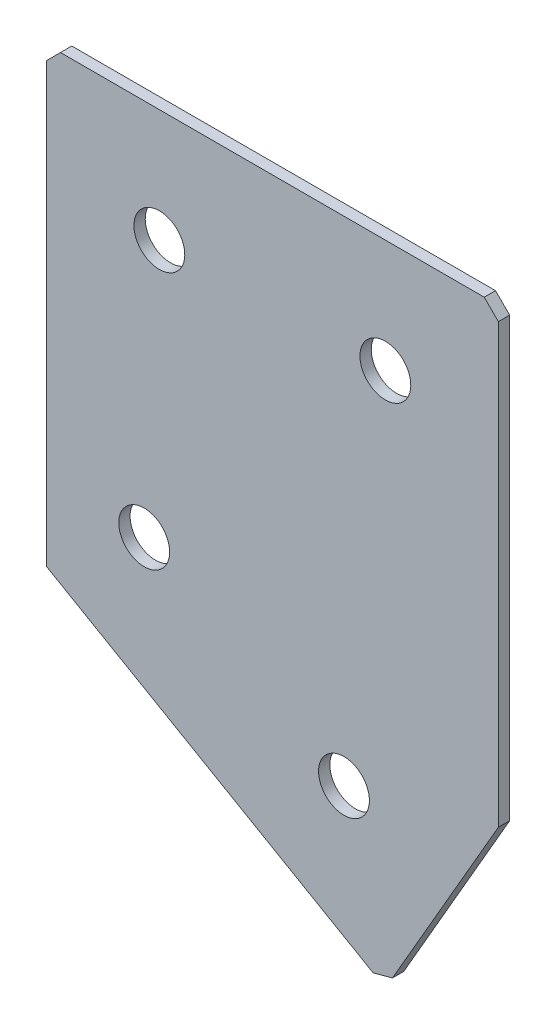
ISO-10303-21;
HEADER;
FILE_DESCRIPTION(('STEP AP214'),'2;1');
FILE_NAME('part.step','',(''),(''),'','','');
FILE_SCHEMA(('AUTOMOTIVE_DESIGN { 1 0 10303 214 1 1 1 1 }'));
ENDSEC;
DATA;
#1=APPLICATION_CONTEXT('core data for automotive mechanical design processes');
#2=APPLICATION_PROTOCOL_DEFINITION('international standard','automotive_design',2000,#1);
#3=PRODUCT_CONTEXT('',#1,'mechanical');
#4=PRODUCT('Part','Part','',(#3));
#5=PRODUCT_RELATED_PRODUCT_CATEGORY('part','',(#4));
#6=PRODUCT_DEFINITION_FORMATION('','',#4);
#7=PRODUCT_DEFINITION_CONTEXT('part definition',#1,'design');
#8=PRODUCT_DEFINITION('design','',#6,#7);
#9=PRODUCT_DEFINITION_SHAPE('','',#8);
#10=(LENGTH_UNIT() NAMED_UNIT(*) SI_UNIT(.MILLI.,.METRE.));
#11=(NAMED_UNIT(*) PLANE_ANGLE_UNIT() SI_UNIT($,.RADIAN.));
#12=(NAMED_UNIT(*) SI_UNIT($,.STERADIAN.) SOLID_ANGLE_UNIT());
#13=UNCERTAINTY_MEASURE_WITH_UNIT(LENGTH_MEASURE(1.E-05),#10,'distance_accuracy_value','');
#14=(GEOMETRIC_REPRESENTATION_CONTEXT(3) GLOBAL_UNCERTAINTY_ASSIGNED_CONTEXT((#13)) GLOBAL_UNIT_ASSIGNED_CONTEXT((#10,
#11,#12)) REPRESENTATION_CONTEXT('',''));
#15=CARTESIAN_POINT('',(0.,0.,0.));
#16=DIRECTION('',(0.,0.,1.));
#17=DIRECTION('',(1.,0.,0.));
#18=AXIS2_PLACEMENT_3D('',#15,#16,#17);
#19=CARTESIAN_POINT('',(0.,0.,-2.));
#20=DIRECTION('',(1.,0.,0.));
#21=DIRECTION('',(0.,0.,-1.));
#22=AXIS2_PLACEMENT_3D('',#19,#20,#21);
#23=PLANE('',#22);
#24=DIRECTION('',(0.,1.,0.));
#25=VECTOR('',#24,1.);
#26=CARTESIAN_POINT('',(0.,0.,0.));
#27=LINE('',#26,#25);
#28=CARTESIAN_POINT('',(0.,-80.,0.));
#29=VERTEX_POINT('',#28);
#30=CARTESIAN_POINT('',(0.,-2.50000000000002,0.));
#31=VERTEX_POINT('',#30);
#32=EDGE_CURVE('E137',#29,#31,#27,.T.);
#33=ORIENTED_EDGE('',*,*,#32,.T.);
#34=DIRECTION('',(0.,0.,-1.));
#35=VECTOR('',#34,1.);
#36=CARTESIAN_POINT('',(0.,-2.50000000000002,-2.));
#37=LINE('',#36,#35);
#38=CARTESIAN_POINT('',(0.,-2.50000000000002,-2.));
#39=VERTEX_POINT('',#38);
#40=EDGE_CURVE('E11',#31,#39,#37,.T.);
#41=ORIENTED_EDGE('',*,*,#40,.T.);
#42=DIRECTION('',(0.,1.,0.));
#43=VECTOR('',#42,1.);
#44=CARTESIAN_POINT('',(0.,0.,-2.));
#45=LINE('',#44,#43);
#46=CARTESIAN_POINT('',(0.,-80.,-2.));
#47=VERTEX_POINT('',#46);
#48=EDGE_CURVE('E153',#47,#39,#45,.T.);
#49=ORIENTED_EDGE('',*,*,#48,.F.);
#50=DIRECTION('',(0.,0.,1.));
#51=VECTOR('',#50,1.);
#52=CARTESIAN_POINT('',(0.,-80.,-2.));
#53=LINE('',#52,#51);
#54=EDGE_CURVE('E125',#47,#29,#53,.T.);
#55=ORIENTED_EDGE('',*,*,#54,.T.);
#56=EDGE_LOOP('',(#33,#41,#49,#55));
#57=FACE_BOUND('',#56,.T.);
#58=ADVANCED_FACE('F39',(#57),#23,.F.);
#59=CARTESIAN_POINT('',(0.,0.,-2.));
#60=DIRECTION('',(0.,-1.,0.));
#61=DIRECTION('',(0.,0.,-1.));
#62=AXIS2_PLACEMENT_3D('',#59,#60,#61);
#63=PLANE('',#62);
#64=DIRECTION('',(1.,0.,0.));
#65=VECTOR('',#64,1.);
#66=CARTESIAN_POINT('',(0.,0.,0.));
#67=LINE('',#66,#65);
#68=CARTESIAN_POINT('',(2.50000000000002,0.,0.));
#69=VERTEX_POINT('',#68);
#70=CARTESIAN_POINT('',(77.5,0.,0.));
#71=VERTEX_POINT('',#70);
#72=EDGE_CURVE('E141',#69,#71,#67,.T.);
#73=ORIENTED_EDGE('',*,*,#72,.T.);
#74=DIRECTION('',(0.,0.,-1.));
#75=VECTOR('',#74,1.);
#76=CARTESIAN_POINT('',(77.5,0.,-2.));
#77=LINE('',#76,#75);
#78=CARTESIAN_POINT('',(77.5,0.,-2.));
#79=VERTEX_POINT('',#78);
#80=EDGE_CURVE('E48',#71,#79,#77,.T.);
#81=ORIENTED_EDGE('',*,*,#80,.T.);
#82=DIRECTION('',(1.,0.,0.));
#83=VECTOR('',#82,1.);
#84=CARTESIAN_POINT('',(0.,0.,-2.));
#85=LINE('',#84,#83);
#86=CARTESIAN_POINT('',(2.50000000000002,0.,-2.));
#87=VERTEX_POINT('',#86);
#88=EDGE_CURVE('E113',#87,#79,#85,.T.);
#89=ORIENTED_EDGE('',*,*,#88,.F.);
#90=DIRECTION('',(0.,0.,1.));
#91=VECTOR('',#90,1.);
#92=CARTESIAN_POINT('',(2.50000000000002,0.,-2.));
#93=LINE('',#92,#91);
#94=EDGE_CURVE('E182',#87,#69,#93,.T.);
#95=ORIENTED_EDGE('',*,*,#94,.T.);
#96=EDGE_LOOP('',(#73,#81,#89,#95));
#97=FACE_BOUND('',#96,.T.);
#98=ADVANCED_FACE('F188',(#97),#63,.F.);
#99=CARTESIAN_POINT('',(80.,0.,-2.));
#100=DIRECTION('',(-1.,0.,0.));
#101=DIRECTION('',(0.,0.,1.));
#102=AXIS2_PLACEMENT_3D('',#99,#100,#101);
#103=PLANE('',#102);
#104=DIRECTION('',(0.,-1.,0.));
#105=VECTOR('',#104,1.);
#106=CARTESIAN_POINT('',(80.,0.,-2.));
#107=LINE('',#106,#105);
#108=CARTESIAN_POINT('',(80.,-2.50000000000003,-2.));
#109=VERTEX_POINT('',#108);
#110=CARTESIAN_POINT('',(80.,-80.0000000000001,-2.));
#111=VERTEX_POINT('',#110);
#112=EDGE_CURVE('E103',#109,#111,#107,.T.);
#113=ORIENTED_EDGE('',*,*,#112,.F.);
#114=DIRECTION('',(0.,0.,1.));
#115=VECTOR('',#114,1.);
#116=CARTESIAN_POINT('',(80.,-2.50000000000003,-2.));
#117=LINE('',#116,#115);
#118=CARTESIAN_POINT('',(80.,-2.50000000000003,0.));
#119=VERTEX_POINT('',#118);
#120=EDGE_CURVE('E179',#109,#119,#117,.T.);
#121=ORIENTED_EDGE('',*,*,#120,.T.);
#122=DIRECTION('',(0.,-1.,0.));
#123=VECTOR('',#122,1.);
#124=CARTESIAN_POINT('',(80.,0.,0.));
#125=LINE('',#124,#123);
#126=CARTESIAN_POINT('',(80.,-80.0000000000001,0.));
#127=VERTEX_POINT('',#126);
#128=EDGE_CURVE('E119',#119,#127,#125,.T.);
#129=ORIENTED_EDGE('',*,*,#128,.T.);
#130=DIRECTION('',(0.,0.,1.));
#131=VECTOR('',#130,1.);
#132=CARTESIAN_POINT('',(80.,-80.0000000000001,-2.));
#133=LINE('',#132,#131);
#134=EDGE_CURVE('E116',#111,#127,#133,.T.);
#135=ORIENTED_EDGE('',*,*,#134,.F.);
#136=EDGE_LOOP('',(#113,#121,#129,#135));
#137=FACE_BOUND('',#136,.T.);
#138=ADVANCED_FACE('F117',(#137),#103,.F.);
#139=CARTESIAN_POINT('',(59.9999999999999,-114.641016151378,-2.));
#140=DIRECTION('',(-0.866025403784438,0.500000000000002,0.));
#141=DIRECTION('',(-0.500000000000002,-0.866025403784438,0.));
#142=AXIS2_PLACEMENT_3D('',#139,#140,#141);
#143=PLANE('',#142);
#144=DIRECTION('',(-0.500000000000002,-0.866025403784438,0.));
#145=VECTOR('',#144,1.);
#146=CARTESIAN_POINT('',(59.9999999999999,-114.641016151378,0.));
#147=LINE('',#146,#145);
#148=CARTESIAN_POINT('',(61.25,-112.475952641916,0.));
#149=VERTEX_POINT('',#148);
#150=EDGE_CURVE('E147',#127,#149,#147,.T.);
#151=ORIENTED_EDGE('',*,*,#150,.T.);
#152=DIRECTION('',(0.,0.,-1.));
#153=VECTOR('',#152,1.);
#154=CARTESIAN_POINT('',(61.25,-112.475952641916,-2.));
#155=LINE('',#154,#153);
#156=CARTESIAN_POINT('',(61.25,-112.475952641916,-2.));
#157=VERTEX_POINT('',#156);
#158=EDGE_CURVE('E129',#149,#157,#155,.T.);
#159=ORIENTED_EDGE('',*,*,#158,.T.);
#160=DIRECTION('',(-0.500000000000002,-0.866025403784438,0.));
#161=VECTOR('',#160,1.);
#162=CARTESIAN_POINT('',(59.9999999999999,-114.641016151378,-2.));
#163=LINE('',#162,#161);
#164=EDGE_CURVE('E107',#111,#157,#163,.T.);
#165=ORIENTED_EDGE('',*,*,#164,.F.);
#166=ORIENTED_EDGE('',*,*,#134,.T.);
#167=EDGE_LOOP('',(#151,#159,#165,#166));
#168=FACE_BOUND('',#167,.T.);
#169=ADVANCED_FACE('F127',(#168),#143,.F.);
#170=CARTESIAN_POINT('',(0.,-80.,-2.));
#171=DIRECTION('',(0.500000000000001,0.866025403784438,0.));
#172=DIRECTION('',(-0.866025403784438,0.500000000000001,0.));
#173=AXIS2_PLACEMENT_3D('',#170,#171,#172);
#174=PLANE('',#173);
#175=DIRECTION('',(-0.866025403784438,0.500000000000001,0.));
#176=VECTOR('',#175,1.);
#177=CARTESIAN_POINT('',(0.,-80.,-2.));
#178=LINE('',#177,#176);
#179=CARTESIAN_POINT('',(57.8349364905388,-113.391016151378,-2.));
#180=VERTEX_POINT('',#179);
#181=EDGE_CURVE('E131',#180,#47,#178,.T.);
#182=ORIENTED_EDGE('',*,*,#181,.F.);
#183=DIRECTION('',(0.,0.,1.));
#184=VECTOR('',#183,1.);
#185=CARTESIAN_POINT('',(57.8349364905388,-113.391016151378,-2.));
#186=LINE('',#185,#184);
#187=CARTESIAN_POINT('',(57.8349364905388,-113.391016151378,0.));
#188=VERTEX_POINT('',#187);
#189=EDGE_CURVE('E124',#180,#188,#186,.T.);
#190=ORIENTED_EDGE('',*,*,#189,.T.);
#191=DIRECTION('',(-0.866025403784438,0.500000000000001,0.));
#192=VECTOR('',#191,1.);
#193=CARTESIAN_POINT('',(0.,-80.,0.));
#194=LINE('',#193,#192);
#195=EDGE_CURVE('E150',#188,#29,#194,.T.);
#196=ORIENTED_EDGE('',*,*,#195,.T.);
#197=ORIENTED_EDGE('',*,*,#54,.F.);
#198=EDGE_LOOP('',(#182,#190,#196,#197));
#199=FACE_BOUND('',#198,.T.);
#200=ADVANCED_FACE('F218',(#199),#174,.F.);
#201=CARTESIAN_POINT('',(0.,0.,-2.));
#202=DIRECTION('',(0.,0.,1.));
#203=DIRECTION('',(1.,0.,0.));
#204=AXIS2_PLACEMENT_3D('',#201,#202,#203);
#205=PLANE('',#204);
#206=CARTESIAN_POINT('',(20.,-20.,-2.));
#207=DIRECTION('',(0.,0.,-1.));
#208=DIRECTION('',(0.,1.,0.));
#209=AXIS2_PLACEMENT_3D('',#206,#207,#208);
#210=CIRCLE('',#209,4.5);
#211=CARTESIAN_POINT('',(20.,-15.5,-2.));
#212=VERTEX_POINT('',#211);
#213=EDGE_CURVE('E250',#212,#212,#210,.T.);
#214=ORIENTED_EDGE('',*,*,#213,.F.);
#215=EDGE_LOOP('',(#214));
#216=FACE_BOUND('',#215,.T.);
#217=CARTESIAN_POINT('',(60.,-20.,-2.));
#218=DIRECTION('',(0.,0.,-1.));
#219=DIRECTION('',(0.,1.,0.));
#220=AXIS2_PLACEMENT_3D('',#217,#218,#219);
#221=CIRCLE('',#220,4.5);
#222=CARTESIAN_POINT('',(60.,-15.5,-2.));
#223=VERTEX_POINT('',#222);
#224=EDGE_CURVE('E254',#223,#223,#221,.T.);
#225=ORIENTED_EDGE('',*,*,#224,.F.);
#226=EDGE_LOOP('',(#225));
#227=FACE_BOUND('',#226,.T.);
#228=CARTESIAN_POINT('',(17.3205080756888,-66.9059892324151,-2.));
#229=DIRECTION('',(0.,0.,-1.));
#230=DIRECTION('',(0.,1.,0.));
#231=AXIS2_PLACEMENT_3D('',#228,#229,#230);
#232=CIRCLE('',#231,4.5);
#233=CARTESIAN_POINT('',(17.3205080756888,-62.4059892324151,-2.));
#234=VERTEX_POINT('',#233);
#235=EDGE_CURVE('E264',#234,#234,#232,.T.);
#236=ORIENTED_EDGE('',*,*,#235,.F.);
#237=EDGE_LOOP('',(#236));
#238=FACE_BOUND('',#237,.T.);
#239=CARTESIAN_POINT('',(52.6794919243112,-87.3205080756889,-2.00000000000001));
#240=DIRECTION('',(0.,0.,-1.));
#241=DIRECTION('',(0.,1.,0.));
#242=AXIS2_PLACEMENT_3D('',#239,#240,#241);
#243=CIRCLE('',#242,4.5);
#244=CARTESIAN_POINT('',(52.6794919243112,-82.8205080756889,-2.));
#245=VERTEX_POINT('',#244);
#246=EDGE_CURVE('E272',#245,#245,#243,.T.);
#247=ORIENTED_EDGE('',*,*,#246,.F.);
#248=EDGE_LOOP('',(#247));
#249=FACE_BOUND('',#248,.T.);
#250=ORIENTED_EDGE('',*,*,#164,.T.);
#251=DIRECTION('',(0.96592582628907,0.258819045102516,0.));
#252=VECTOR('',#251,1.);
#253=CARTESIAN_POINT('',(57.8349364905388,-113.391016151378,-2.));
#254=LINE('',#253,#252);
#255=EDGE_CURVE('E176',#157,#180,#254,.F.);
#256=ORIENTED_EDGE('',*,*,#255,.T.);
#257=ORIENTED_EDGE('',*,*,#181,.T.);
#258=ORIENTED_EDGE('',*,*,#48,.T.);
#259=DIRECTION('',(-0.707106781186548,-0.707106781186548,0.));
#260=VECTOR('',#259,1.);
#261=CARTESIAN_POINT('',(2.50000000000002,0.,-2.));
#262=LINE('',#261,#260);
#263=EDGE_CURVE('E171',#39,#87,#262,.F.);
#264=ORIENTED_EDGE('',*,*,#263,.T.);
#265=ORIENTED_EDGE('',*,*,#88,.T.);
#266=DIRECTION('',(-0.707106781186546,0.707106781186549,0.));
#267=VECTOR('',#266,1.);
#268=CARTESIAN_POINT('',(80.,-2.50000000000003,-2.));
#269=LINE('',#268,#267);
#270=EDGE_CURVE('E55',#79,#109,#269,.F.);
#271=ORIENTED_EDGE('',*,*,#270,.T.);
#272=ORIENTED_EDGE('',*,*,#112,.T.);
#273=EDGE_LOOP('',(#250,#256,#257,#258,#264,#265,#271,#272));
#274=FACE_BOUND('',#273,.T.);
#275=ADVANCED_FACE('F105',(#216,#227,#238,#249,#274),#205,.F.);
#276=CARTESIAN_POINT('',(0.,0.,0.));
#277=DIRECTION('',(0.,0.,1.));
#278=DIRECTION('',(1.,0.,0.));
#279=AXIS2_PLACEMENT_3D('',#276,#277,#278);
#280=PLANE('',#279);
#281=CARTESIAN_POINT('',(20.,-20.,0.));
#282=DIRECTION('',(0.,0.,-1.));
#283=DIRECTION('',(0.,1.,0.));
#284=AXIS2_PLACEMENT_3D('',#281,#282,#283);
#285=CIRCLE('',#284,4.5);
#286=CARTESIAN_POINT('',(20.,-15.5,0.));
#287=VERTEX_POINT('',#286);
#288=EDGE_CURVE('E247',#287,#287,#285,.T.);
#289=ORIENTED_EDGE('',*,*,#288,.T.);
#290=EDGE_LOOP('',(#289));
#291=FACE_BOUND('',#290,.T.);
#292=CARTESIAN_POINT('',(60.,-20.,0.));
#293=DIRECTION('',(0.,0.,-1.));
#294=DIRECTION('',(0.,1.,0.));
#295=AXIS2_PLACEMENT_3D('',#292,#293,#294);
#296=CIRCLE('',#295,4.5);
#297=CARTESIAN_POINT('',(60.,-15.5,0.));
#298=VERTEX_POINT('',#297);
#299=EDGE_CURVE('E260',#298,#298,#296,.T.);
#300=ORIENTED_EDGE('',*,*,#299,.T.);
#301=EDGE_LOOP('',(#300));
#302=FACE_BOUND('',#301,.T.);
#303=CARTESIAN_POINT('',(17.3205080756888,-66.9059892324151,0.));
#304=DIRECTION('',(0.,0.,-1.));
#305=DIRECTION('',(0.,1.,0.));
#306=AXIS2_PLACEMENT_3D('',#303,#304,#305);
#307=CIRCLE('',#306,4.5);
#308=CARTESIAN_POINT('',(17.3205080756888,-62.4059892324151,0.));
#309=VERTEX_POINT('',#308);
#310=EDGE_CURVE('E268',#309,#309,#307,.T.);
#311=ORIENTED_EDGE('',*,*,#310,.T.);
#312=EDGE_LOOP('',(#311));
#313=FACE_BOUND('',#312,.T.);
#314=CARTESIAN_POINT('',(52.6794919243112,-87.3205080756889,0.));
#315=DIRECTION('',(0.,0.,-1.));
#316=DIRECTION('',(0.,1.,0.));
#317=AXIS2_PLACEMENT_3D('',#314,#315,#316);
#318=CIRCLE('',#317,4.5);
#319=CARTESIAN_POINT('',(52.6794919243112,-82.8205080756889,0.));
#320=VERTEX_POINT('',#319);
#321=EDGE_CURVE('E142',#320,#320,#318,.T.);
#322=ORIENTED_EDGE('',*,*,#321,.T.);
#323=EDGE_LOOP('',(#322));
#324=FACE_BOUND('',#323,.T.);
#325=ORIENTED_EDGE('',*,*,#195,.F.);
#326=DIRECTION('',(-0.96592582628907,-0.258819045102516,0.));
#327=VECTOR('',#326,1.);
#328=CARTESIAN_POINT('',(32.22196016958,-120.253992472336,0.));
#329=LINE('',#328,#327);
#330=EDGE_CURVE('E166',#188,#149,#329,.F.);
#331=ORIENTED_EDGE('',*,*,#330,.T.);
#332=ORIENTED_EDGE('',*,*,#150,.F.);
#333=ORIENTED_EDGE('',*,*,#128,.F.);
#334=DIRECTION('',(0.707106781186546,-0.707106781186549,0.));
#335=VECTOR('',#334,1.);
#336=CARTESIAN_POINT('',(38.7500000000002,38.75,0.));
#337=LINE('',#336,#335);
#338=EDGE_CURVE('E163',#119,#71,#337,.F.);
#339=ORIENTED_EDGE('',*,*,#338,.T.);
#340=ORIENTED_EDGE('',*,*,#72,.F.);
#341=DIRECTION('',(0.707106781186548,0.707106781186548,0.));
#342=VECTOR('',#341,1.);
#343=CARTESIAN_POINT('',(1.25000000000001,-1.25000000000001,0.));
#344=LINE('',#343,#342);
#345=EDGE_CURVE('E160',#69,#31,#344,.F.);
#346=ORIENTED_EDGE('',*,*,#345,.T.);
#347=ORIENTED_EDGE('',*,*,#32,.F.);
#348=EDGE_LOOP('',(#325,#331,#332,#333,#339,#340,#346,#347));
#349=FACE_BOUND('',#348,.T.);
#350=ADVANCED_FACE('F193',(#291,#302,#313,#324,#349),#280,.T.);
#351=CARTESIAN_POINT('',(52.6794919243112,-87.3205080756889,-2.00000000000001));
#352=DIRECTION('',(0.,0.,-1.));
#353=DIRECTION('',(0.,1.,0.));
#354=AXIS2_PLACEMENT_3D('',#351,#352,#353);
#355=CYLINDRICAL_SURFACE('',#354,4.5);
#356=ORIENTED_EDGE('',*,*,#321,.F.);
#357=EDGE_LOOP('',(#356));
#358=FACE_BOUND('',#357,.T.);
#359=ORIENTED_EDGE('',*,*,#246,.T.);
#360=EDGE_LOOP('',(#359));
#361=FACE_BOUND('',#360,.T.);
#362=ADVANCED_FACE('F224',(#358,#361),#355,.F.);
#363=CARTESIAN_POINT('',(17.3205080756888,-66.9059892324151,-2.));
#364=DIRECTION('',(0.,0.,-1.));
#365=DIRECTION('',(0.,1.,0.));
#366=AXIS2_PLACEMENT_3D('',#363,#364,#365);
#367=CYLINDRICAL_SURFACE('',#366,4.5);
#368=ORIENTED_EDGE('',*,*,#310,.F.);
#369=EDGE_LOOP('',(#368));
#370=FACE_BOUND('',#369,.T.);
#371=ORIENTED_EDGE('',*,*,#235,.T.);
#372=EDGE_LOOP('',(#371));
#373=FACE_BOUND('',#372,.T.);
#374=ADVANCED_FACE('F231',(#370,#373),#367,.F.);
#375=CARTESIAN_POINT('',(60.,-20.,-2.));
#376=DIRECTION('',(0.,0.,-1.));
#377=DIRECTION('',(0.,1.,0.));
#378=AXIS2_PLACEMENT_3D('',#375,#376,#377);
#379=CYLINDRICAL_SURFACE('',#378,4.5);
#380=ORIENTED_EDGE('',*,*,#299,.F.);
#381=EDGE_LOOP('',(#380));
#382=FACE_BOUND('',#381,.T.);
#383=ORIENTED_EDGE('',*,*,#224,.T.);
#384=EDGE_LOOP('',(#383));
#385=FACE_BOUND('',#384,.T.);
#386=ADVANCED_FACE('F235',(#382,#385),#379,.F.);
#387=CARTESIAN_POINT('',(20.,-20.,-2.));
#388=DIRECTION('',(0.,0.,-1.));
#389=DIRECTION('',(0.,1.,0.));
#390=AXIS2_PLACEMENT_3D('',#387,#388,#389);
#391=CYLINDRICAL_SURFACE('',#390,4.5);
#392=ORIENTED_EDGE('',*,*,#288,.F.);
#393=EDGE_LOOP('',(#392));
#394=FACE_BOUND('',#393,.T.);
#395=ORIENTED_EDGE('',*,*,#213,.T.);
#396=EDGE_LOOP('',(#395));
#397=FACE_BOUND('',#396,.T.);
#398=ADVANCED_FACE('F203',(#394,#397),#391,.F.);
#399=CARTESIAN_POINT('',(57.8349364905388,-113.391016151378,-2.));
#400=DIRECTION('',(-0.258819045102516,0.96592582628907,0.));
#401=DIRECTION('',(0.,0.,1.));
#402=AXIS2_PLACEMENT_3D('',#399,#400,#401);
#403=PLANE('',#402);
#404=ORIENTED_EDGE('',*,*,#255,.F.);
#405=ORIENTED_EDGE('',*,*,#158,.F.);
#406=ORIENTED_EDGE('',*,*,#330,.F.);
#407=ORIENTED_EDGE('',*,*,#189,.F.);
#408=EDGE_LOOP('',(#404,#405,#406,#407));
#409=FACE_BOUND('',#408,.T.);
#410=ADVANCED_FACE('F198',(#409),#403,.F.);
#411=CARTESIAN_POINT('',(80.,-2.50000000000003,-2.));
#412=DIRECTION('',(-0.707106781186549,-0.707106781186546,0.));
#413=DIRECTION('',(0.,0.,1.));
#414=AXIS2_PLACEMENT_3D('',#411,#412,#413);
#415=PLANE('',#414);
#416=ORIENTED_EDGE('',*,*,#270,.F.);
#417=ORIENTED_EDGE('',*,*,#80,.F.);
#418=ORIENTED_EDGE('',*,*,#338,.F.);
#419=ORIENTED_EDGE('',*,*,#120,.F.);
#420=EDGE_LOOP('',(#416,#417,#418,#419));
#421=FACE_BOUND('',#420,.T.);
#422=ADVANCED_FACE('F196',(#421),#415,.F.);
#423=CARTESIAN_POINT('',(2.50000000000002,0.,-2.));
#424=DIRECTION('',(0.707106781186547,-0.707106781186547,0.));
#425=DIRECTION('',(0.,0.,1.));
#426=AXIS2_PLACEMENT_3D('',#423,#424,#425);
#427=PLANE('',#426);
#428=ORIENTED_EDGE('',*,*,#263,.F.);
#429=ORIENTED_EDGE('',*,*,#40,.F.);
#430=ORIENTED_EDGE('',*,*,#345,.F.);
#431=ORIENTED_EDGE('',*,*,#94,.F.);
#432=EDGE_LOOP('',(#428,#429,#430,#431));
#433=FACE_BOUND('',#432,.T.);
#434=ADVANCED_FACE('F41',(#433),#427,.F.);
#435=CLOSED_SHELL('',(#58,#98,#138,#169,#200,#275,#350,#362,#374,#386,#398,#410,#422,#434));
#436=MANIFOLD_SOLID_BREP('B2',#435);
#437=ADVANCED_BREP_SHAPE_REPRESENTATION('',(#18,#436),#14);
#438=SHAPE_DEFINITION_REPRESENTATION(#9,#437);
ENDSEC;
END-ISO-10303-21;
